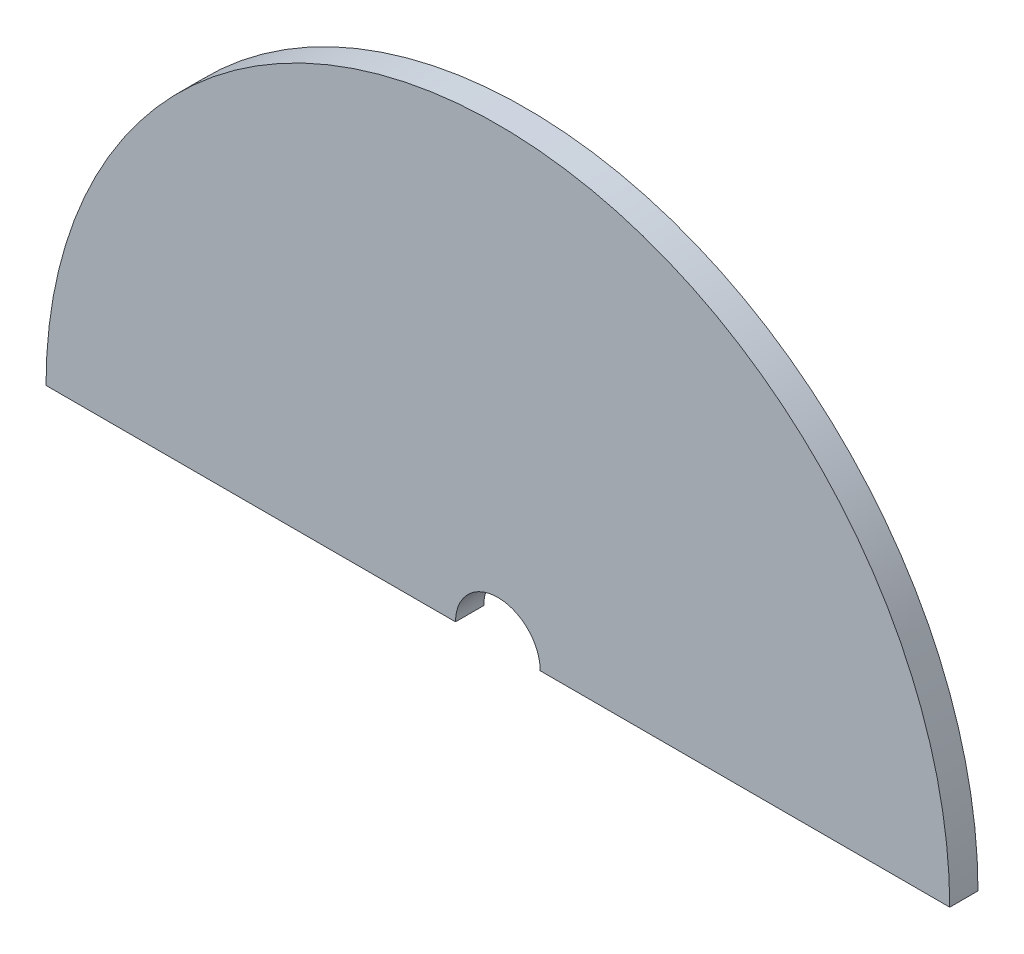
ISO-10303-21;
HEADER;
FILE_DESCRIPTION(('STEP AP214'),'2;1');
FILE_NAME('part.step','',(''),(''),'','','');
FILE_SCHEMA(('AUTOMOTIVE_DESIGN { 1 0 10303 214 1 1 1 1 }'));
ENDSEC;
DATA;
#1=APPLICATION_CONTEXT('core data for automotive mechanical design processes');
#2=APPLICATION_PROTOCOL_DEFINITION('international standard','automotive_design',2000,#1);
#3=PRODUCT_CONTEXT('',#1,'mechanical');
#4=PRODUCT('Part','Part','',(#3));
#5=PRODUCT_RELATED_PRODUCT_CATEGORY('part','',(#4));
#6=PRODUCT_DEFINITION_FORMATION('','',#4);
#7=PRODUCT_DEFINITION_CONTEXT('part definition',#1,'design');
#8=PRODUCT_DEFINITION('design','',#6,#7);
#9=PRODUCT_DEFINITION_SHAPE('','',#8);
#10=(LENGTH_UNIT() NAMED_UNIT(*) SI_UNIT(.MILLI.,.METRE.));
#11=(NAMED_UNIT(*) PLANE_ANGLE_UNIT() SI_UNIT($,.RADIAN.));
#12=(NAMED_UNIT(*) SI_UNIT($,.STERADIAN.) SOLID_ANGLE_UNIT());
#13=UNCERTAINTY_MEASURE_WITH_UNIT(LENGTH_MEASURE(1.E-05),#10,'distance_accuracy_value','');
#14=(GEOMETRIC_REPRESENTATION_CONTEXT(3) GLOBAL_UNCERTAINTY_ASSIGNED_CONTEXT((#13)) GLOBAL_UNIT_ASSIGNED_CONTEXT((#10,
#11,#12)) REPRESENTATION_CONTEXT('',''));
#15=CARTESIAN_POINT('',(0.,0.,0.));
#16=DIRECTION('',(0.,0.,1.));
#17=DIRECTION('',(1.,0.,0.));
#18=AXIS2_PLACEMENT_3D('',#15,#16,#17);
#19=CARTESIAN_POINT('',(0.,160.,10.));
#20=DIRECTION('',(0.,1.,0.));
#21=DIRECTION('',(-1.,0.,0.));
#22=AXIS2_PLACEMENT_3D('',#19,#20,#21);
#23=PLANE('',#22);
#24=DIRECTION('',(1.,0.,0.));
#25=VECTOR('',#24,1.);
#26=CARTESIAN_POINT('',(0.,160.,0.));
#27=LINE('',#26,#25);
#28=CARTESIAN_POINT('',(-160.,160.,0.));
#29=VERTEX_POINT('',#28);
#30=CARTESIAN_POINT('',(-15.,160.,0.));
#31=VERTEX_POINT('',#30);
#32=EDGE_CURVE('E83',#29,#31,#27,.T.);
#33=ORIENTED_EDGE('',*,*,#32,.T.);
#34=DIRECTION('',(0.,0.,1.));
#35=VECTOR('',#34,1.);
#36=CARTESIAN_POINT('',(-15.,160.,-10.));
#37=LINE('',#36,#35);
#38=CARTESIAN_POINT('',(-15.,160.,10.));
#39=VERTEX_POINT('',#38);
#40=EDGE_CURVE('E50',#31,#39,#37,.T.);
#41=ORIENTED_EDGE('',*,*,#40,.T.);
#42=DIRECTION('',(1.,0.,0.));
#43=VECTOR('',#42,1.);
#44=CARTESIAN_POINT('',(0.,160.,10.));
#45=LINE('',#44,#43);
#46=CARTESIAN_POINT('',(-160.,160.,10.));
#47=VERTEX_POINT('',#46);
#48=EDGE_CURVE('E58',#47,#39,#45,.T.);
#49=ORIENTED_EDGE('',*,*,#48,.F.);
#50=DIRECTION('',(0.,0.,-1.));
#51=VECTOR('',#50,1.);
#52=CARTESIAN_POINT('',(-160.,160.,10.));
#53=LINE('',#52,#51);
#54=EDGE_CURVE('E75',#47,#29,#53,.T.);
#55=ORIENTED_EDGE('',*,*,#54,.T.);
#56=EDGE_LOOP('',(#33,#41,#49,#55));
#57=FACE_BOUND('',#56,.T.);
#58=ADVANCED_FACE('F36',(#57),#23,.F.);
#59=CARTESIAN_POINT('',(0.,160.,10.));
#60=DIRECTION('',(0.,0.,-1.));
#61=DIRECTION('',(-1.,0.,0.));
#62=AXIS2_PLACEMENT_3D('',#59,#60,#61);
#63=CYLINDRICAL_SURFACE('',#62,160.);
#64=CARTESIAN_POINT('',(0.,160.,0.));
#65=DIRECTION('',(0.,0.,1.));
#66=DIRECTION('',(-1.,0.,0.));
#67=AXIS2_PLACEMENT_3D('',#64,#65,#66);
#68=CIRCLE('',#67,160.);
#69=CARTESIAN_POINT('',(160.,160.,0.));
#70=VERTEX_POINT('',#69);
#71=EDGE_CURVE('E73',#70,#29,#68,.T.);
#72=ORIENTED_EDGE('',*,*,#71,.T.);
#73=ORIENTED_EDGE('',*,*,#54,.F.);
#74=CARTESIAN_POINT('',(0.,160.,10.));
#75=DIRECTION('',(0.,0.,1.));
#76=DIRECTION('',(-1.,0.,0.));
#77=AXIS2_PLACEMENT_3D('',#74,#75,#76);
#78=CIRCLE('',#77,160.);
#79=CARTESIAN_POINT('',(160.,160.,10.));
#80=VERTEX_POINT('',#79);
#81=EDGE_CURVE('E84',#80,#47,#78,.T.);
#82=ORIENTED_EDGE('',*,*,#81,.F.);
#83=DIRECTION('',(0.,0.,-1.));
#84=VECTOR('',#83,1.);
#85=CARTESIAN_POINT('',(160.,160.,10.));
#86=LINE('',#85,#84);
#87=EDGE_CURVE('E44',#80,#70,#86,.T.);
#88=ORIENTED_EDGE('',*,*,#87,.T.);
#89=EDGE_LOOP('',(#72,#73,#82,#88));
#90=FACE_BOUND('',#89,.T.);
#91=ADVANCED_FACE('F38',(#90),#63,.T.);
#92=CARTESIAN_POINT('',(15.,160.,10.));
#93=VERTEX_POINT('',#92);
#94=EDGE_CURVE('E87',#93,#80,#45,.T.);
#95=ORIENTED_EDGE('',*,*,#94,.F.);
#96=DIRECTION('',(0.,0.,1.));
#97=VECTOR('',#96,1.);
#98=CARTESIAN_POINT('',(15.,160.,-10.));
#99=LINE('',#98,#97);
#100=CARTESIAN_POINT('',(15.,160.,0.));
#101=VERTEX_POINT('',#100);
#102=EDGE_CURVE('E93',#93,#101,#99,.F.);
#103=ORIENTED_EDGE('',*,*,#102,.T.);
#104=EDGE_CURVE('E80',#101,#70,#27,.T.);
#105=ORIENTED_EDGE('',*,*,#104,.T.);
#106=ORIENTED_EDGE('',*,*,#87,.F.);
#107=EDGE_LOOP('',(#95,#103,#105,#106));
#108=FACE_BOUND('',#107,.T.);
#109=ADVANCED_FACE('F107',(#108),#23,.F.);
#110=CARTESIAN_POINT('',(0.,160.,10.));
#111=DIRECTION('',(0.,0.,-1.));
#112=DIRECTION('',(-1.,0.,0.));
#113=AXIS2_PLACEMENT_3D('',#110,#111,#112);
#114=PLANE('',#113);
#115=ORIENTED_EDGE('',*,*,#48,.T.);
#116=CARTESIAN_POINT('',(0.,160.,10.));
#117=DIRECTION('',(0.,0.,1.));
#118=DIRECTION('',(1.,0.,0.));
#119=AXIS2_PLACEMENT_3D('',#116,#117,#118);
#120=CIRCLE('',#119,15.);
#121=EDGE_CURVE('E96',#93,#39,#120,.T.);
#122=ORIENTED_EDGE('',*,*,#121,.F.);
#123=ORIENTED_EDGE('',*,*,#94,.T.);
#124=ORIENTED_EDGE('',*,*,#81,.T.);
#125=EDGE_LOOP('',(#115,#122,#123,#124));
#126=FACE_BOUND('',#125,.T.);
#127=ADVANCED_FACE('F105',(#126),#114,.F.);
#128=CARTESIAN_POINT('',(0.,160.,0.));
#129=DIRECTION('',(0.,0.,-1.));
#130=DIRECTION('',(-1.,0.,0.));
#131=AXIS2_PLACEMENT_3D('',#128,#129,#130);
#132=PLANE('',#131);
#133=CARTESIAN_POINT('',(0.,160.,0.));
#134=DIRECTION('',(0.,0.,-1.));
#135=DIRECTION('',(-1.,0.,0.));
#136=AXIS2_PLACEMENT_3D('',#133,#134,#135);
#137=CIRCLE('',#136,15.);
#138=EDGE_CURVE('E11',#31,#101,#137,.T.);
#139=ORIENTED_EDGE('',*,*,#138,.F.);
#140=ORIENTED_EDGE('',*,*,#32,.F.);
#141=ORIENTED_EDGE('',*,*,#71,.F.);
#142=ORIENTED_EDGE('',*,*,#104,.F.);
#143=EDGE_LOOP('',(#139,#140,#141,#142));
#144=FACE_BOUND('',#143,.T.);
#145=ADVANCED_FACE('F86',(#144),#132,.T.);
#146=CARTESIAN_POINT('',(0.,160.,-10.));
#147=DIRECTION('',(0.,0.,1.));
#148=DIRECTION('',(1.,0.,0.));
#149=AXIS2_PLACEMENT_3D('',#146,#147,#148);
#150=CYLINDRICAL_SURFACE('',#149,15.);
#151=ORIENTED_EDGE('',*,*,#138,.T.);
#152=ORIENTED_EDGE('',*,*,#102,.F.);
#153=ORIENTED_EDGE('',*,*,#121,.T.);
#154=ORIENTED_EDGE('',*,*,#40,.F.);
#155=EDGE_LOOP('',(#151,#152,#153,#154));
#156=FACE_BOUND('',#155,.T.);
#157=ADVANCED_FACE('F100',(#156),#150,.F.);
#158=CLOSED_SHELL('',(#58,#91,#109,#127,#145,#157));
#159=MANIFOLD_SOLID_BREP('B2',#158);
#160=ADVANCED_BREP_SHAPE_REPRESENTATION('',(#18,#159),#14);
#161=SHAPE_DEFINITION_REPRESENTATION(#9,#160);
ENDSEC;
END-ISO-10303-21;
